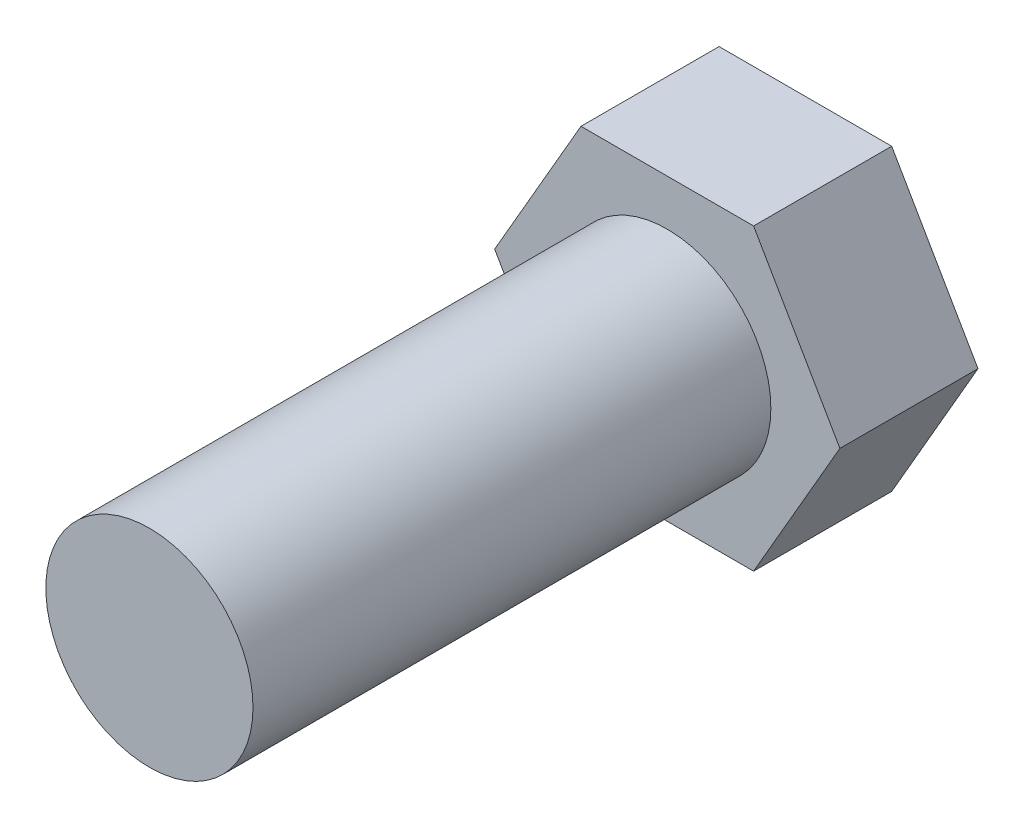
ISO-10303-21;
HEADER;
FILE_DESCRIPTION(('STEP AP214'),'2;1');
FILE_NAME('part.step','',(''),(''),'','','');
FILE_SCHEMA(('AUTOMOTIVE_DESIGN { 1 0 10303 214 1 1 1 1 }'));
ENDSEC;
DATA;
#1=APPLICATION_CONTEXT('core data for automotive mechanical design processes');
#2=APPLICATION_PROTOCOL_DEFINITION('international standard','automotive_design',2000,#1);
#3=PRODUCT_CONTEXT('',#1,'mechanical');
#4=PRODUCT('Part','Part','',(#3));
#5=PRODUCT_RELATED_PRODUCT_CATEGORY('part','',(#4));
#6=PRODUCT_DEFINITION_FORMATION('','',#4);
#7=PRODUCT_DEFINITION_CONTEXT('part definition',#1,'design');
#8=PRODUCT_DEFINITION('design','',#6,#7);
#9=PRODUCT_DEFINITION_SHAPE('','',#8);
#10=(LENGTH_UNIT() NAMED_UNIT(*) SI_UNIT(.MILLI.,.METRE.));
#11=(NAMED_UNIT(*) PLANE_ANGLE_UNIT() SI_UNIT($,.RADIAN.));
#12=(NAMED_UNIT(*) SI_UNIT($,.STERADIAN.) SOLID_ANGLE_UNIT());
#13=UNCERTAINTY_MEASURE_WITH_UNIT(LENGTH_MEASURE(1.E-05),#10,'distance_accuracy_value','');
#14=(GEOMETRIC_REPRESENTATION_CONTEXT(3) GLOBAL_UNCERTAINTY_ASSIGNED_CONTEXT((#13)) GLOBAL_UNIT_ASSIGNED_CONTEXT((#10,
#11,#12)) REPRESENTATION_CONTEXT('',''));
#15=CARTESIAN_POINT('',(0.,0.,0.));
#16=DIRECTION('',(0.,0.,1.));
#17=DIRECTION('',(1.,0.,0.));
#18=AXIS2_PLACEMENT_3D('',#15,#16,#17);
#19=CARTESIAN_POINT('',(0.,0.,15.));
#20=DIRECTION('',(0.,0.,-1.));
#21=DIRECTION('',(-1.,0.,0.));
#22=AXIS2_PLACEMENT_3D('',#19,#20,#21);
#23=CYLINDRICAL_SURFACE('',#22,3.);
#24=CARTESIAN_POINT('',(0.,0.,15.));
#25=DIRECTION('',(0.,0.,1.));
#26=DIRECTION('',(1.,0.,0.));
#27=AXIS2_PLACEMENT_3D('',#24,#25,#26);
#28=CIRCLE('',#27,3.);
#29=CARTESIAN_POINT('',(3.,0.,15.));
#30=VERTEX_POINT('',#29);
#31=EDGE_CURVE('E11',#30,#30,#28,.T.);
#32=ORIENTED_EDGE('',*,*,#31,.F.);
#33=EDGE_LOOP('',(#32));
#34=FACE_BOUND('',#33,.T.);
#35=CARTESIAN_POINT('',(0.,0.,0.));
#36=DIRECTION('',(0.,0.,1.));
#37=DIRECTION('',(1.,0.,0.));
#38=AXIS2_PLACEMENT_3D('',#35,#36,#37);
#39=CIRCLE('',#38,3.);
#40=CARTESIAN_POINT('',(3.,0.,0.));
#41=VERTEX_POINT('',#40);
#42=EDGE_CURVE('E37',#41,#41,#39,.T.);
#43=ORIENTED_EDGE('',*,*,#42,.T.);
#44=EDGE_LOOP('',(#43));
#45=FACE_BOUND('',#44,.T.);
#46=ADVANCED_FACE('F34',(#34,#45),#23,.T.);
#47=CARTESIAN_POINT('',(0.,0.,15.));
#48=DIRECTION('',(0.,0.,1.));
#49=DIRECTION('',(1.,0.,0.));
#50=AXIS2_PLACEMENT_3D('',#47,#48,#49);
#51=PLANE('',#50);
#52=ORIENTED_EDGE('',*,*,#31,.T.);
#53=EDGE_LOOP('',(#52));
#54=FACE_BOUND('',#53,.T.);
#55=ADVANCED_FACE('F161',(#54),#51,.T.);
#56=CARTESIAN_POINT('',(-2.5,-4.3301270189222,-4.));
#57=DIRECTION('',(0.866025403784439,0.499999999999999,0.));
#58=DIRECTION('',(-0.499999999999999,0.866025403784439,0.));
#59=AXIS2_PLACEMENT_3D('',#56,#57,#58);
#60=PLANE('',#59);
#61=DIRECTION('',(-0.5,0.866025403784439,0.));
#62=VECTOR('',#61,1.);
#63=CARTESIAN_POINT('',(-2.5,-4.3301270189222,0.));
#64=LINE('',#63,#62);
#65=CARTESIAN_POINT('',(-2.5,-4.3301270189222,0.));
#66=VERTEX_POINT('',#65);
#67=CARTESIAN_POINT('',(-5.,0.,0.));
#68=VERTEX_POINT('',#67);
#69=EDGE_CURVE('E119',#66,#68,#64,.T.);
#70=ORIENTED_EDGE('',*,*,#69,.T.);
#71=DIRECTION('',(0.,0.,1.));
#72=VECTOR('',#71,1.);
#73=CARTESIAN_POINT('',(-5.,0.,-4.));
#74=LINE('',#73,#72);
#75=CARTESIAN_POINT('',(-5.,0.,-4.));
#76=VERTEX_POINT('',#75);
#77=EDGE_CURVE('E136',#76,#68,#74,.T.);
#78=ORIENTED_EDGE('',*,*,#77,.F.);
#79=DIRECTION('',(-0.5,0.866025403784439,0.));
#80=VECTOR('',#79,1.);
#81=CARTESIAN_POINT('',(-2.5,-4.3301270189222,-4.));
#82=LINE('',#81,#80);
#83=CARTESIAN_POINT('',(-2.5,-4.3301270189222,-4.));
#84=VERTEX_POINT('',#83);
#85=EDGE_CURVE('E129',#84,#76,#82,.T.);
#86=ORIENTED_EDGE('',*,*,#85,.F.);
#87=DIRECTION('',(0.,0.,1.));
#88=VECTOR('',#87,1.);
#89=CARTESIAN_POINT('',(-2.5,-4.3301270189222,-4.));
#90=LINE('',#89,#88);
#91=EDGE_CURVE('E115',#84,#66,#90,.T.);
#92=ORIENTED_EDGE('',*,*,#91,.T.);
#93=EDGE_LOOP('',(#70,#78,#86,#92));
#94=FACE_BOUND('',#93,.T.);
#95=ADVANCED_FACE('F149',(#94),#60,.F.);
#96=CARTESIAN_POINT('',(-5.,0.,-4.));
#97=DIRECTION('',(0.866025403784439,-0.5,0.));
#98=DIRECTION('',(0.5,0.866025403784439,0.));
#99=AXIS2_PLACEMENT_3D('',#96,#97,#98);
#100=PLANE('',#99);
#101=DIRECTION('',(0.5,0.866025403784439,0.));
#102=VECTOR('',#101,1.);
#103=CARTESIAN_POINT('',(-5.,0.,0.));
#104=LINE('',#103,#102);
#105=CARTESIAN_POINT('',(-2.5,4.33012701892219,0.));
#106=VERTEX_POINT('',#105);
#107=EDGE_CURVE('E122',#68,#106,#104,.T.);
#108=ORIENTED_EDGE('',*,*,#107,.T.);
#109=DIRECTION('',(0.,0.,1.));
#110=VECTOR('',#109,1.);
#111=CARTESIAN_POINT('',(-2.5,4.33012701892219,-4.));
#112=LINE('',#111,#110);
#113=CARTESIAN_POINT('',(-2.5,4.33012701892219,-4.));
#114=VERTEX_POINT('',#113);
#115=EDGE_CURVE('E133',#114,#106,#112,.T.);
#116=ORIENTED_EDGE('',*,*,#115,.F.);
#117=DIRECTION('',(0.5,0.866025403784439,0.));
#118=VECTOR('',#117,1.);
#119=CARTESIAN_POINT('',(-5.,0.,-4.));
#120=LINE('',#119,#118);
#121=EDGE_CURVE('E88',#76,#114,#120,.T.);
#122=ORIENTED_EDGE('',*,*,#121,.F.);
#123=ORIENTED_EDGE('',*,*,#77,.T.);
#124=EDGE_LOOP('',(#108,#116,#122,#123));
#125=FACE_BOUND('',#124,.T.);
#126=ADVANCED_FACE('F171',(#125),#100,.F.);
#127=CARTESIAN_POINT('',(-2.5,4.33012701892219,-4.));
#128=DIRECTION('',(0.,-1.,0.));
#129=DIRECTION('',(0.,0.,-1.));
#130=AXIS2_PLACEMENT_3D('',#127,#128,#129);
#131=PLANE('',#130);
#132=DIRECTION('',(1.,0.,0.));
#133=VECTOR('',#132,1.);
#134=CARTESIAN_POINT('',(-2.5,4.33012701892219,0.));
#135=LINE('',#134,#133);
#136=CARTESIAN_POINT('',(2.5,4.33012701892219,0.));
#137=VERTEX_POINT('',#136);
#138=EDGE_CURVE('E124',#106,#137,#135,.T.);
#139=ORIENTED_EDGE('',*,*,#138,.T.);
#140=DIRECTION('',(0.,0.,1.));
#141=VECTOR('',#140,1.);
#142=CARTESIAN_POINT('',(2.5,4.33012701892219,-4.));
#143=LINE('',#142,#141);
#144=CARTESIAN_POINT('',(2.5,4.33012701892219,-4.));
#145=VERTEX_POINT('',#144);
#146=EDGE_CURVE('E110',#145,#137,#143,.T.);
#147=ORIENTED_EDGE('',*,*,#146,.F.);
#148=DIRECTION('',(1.,0.,0.));
#149=VECTOR('',#148,1.);
#150=CARTESIAN_POINT('',(-2.5,4.33012701892219,-4.));
#151=LINE('',#150,#149);
#152=EDGE_CURVE('E101',#114,#145,#151,.T.);
#153=ORIENTED_EDGE('',*,*,#152,.F.);
#154=ORIENTED_EDGE('',*,*,#115,.T.);
#155=EDGE_LOOP('',(#139,#147,#153,#154));
#156=FACE_BOUND('',#155,.T.);
#157=ADVANCED_FACE('F176',(#156),#131,.F.);
#158=CARTESIAN_POINT('',(2.5,4.33012701892219,-4.));
#159=DIRECTION('',(-0.866025403784439,-0.5,0.));
#160=DIRECTION('',(0.5,-0.866025403784439,0.));
#161=AXIS2_PLACEMENT_3D('',#158,#159,#160);
#162=PLANE('',#161);
#163=DIRECTION('',(0.5,-0.866025403784439,0.));
#164=VECTOR('',#163,1.);
#165=CARTESIAN_POINT('',(2.5,4.33012701892219,0.));
#166=LINE('',#165,#164);
#167=CARTESIAN_POINT('',(5.,0.,0.));
#168=VERTEX_POINT('',#167);
#169=EDGE_CURVE('E109',#137,#168,#166,.T.);
#170=ORIENTED_EDGE('',*,*,#169,.T.);
#171=DIRECTION('',(0.,0.,1.));
#172=VECTOR('',#171,1.);
#173=CARTESIAN_POINT('',(5.,0.,-4.));
#174=LINE('',#173,#172);
#175=CARTESIAN_POINT('',(5.,0.,-4.));
#176=VERTEX_POINT('',#175);
#177=EDGE_CURVE('E106',#176,#168,#174,.T.);
#178=ORIENTED_EDGE('',*,*,#177,.F.);
#179=DIRECTION('',(0.5,-0.866025403784439,0.));
#180=VECTOR('',#179,1.);
#181=CARTESIAN_POINT('',(2.5,4.33012701892219,-4.));
#182=LINE('',#181,#180);
#183=EDGE_CURVE('E95',#145,#176,#182,.T.);
#184=ORIENTED_EDGE('',*,*,#183,.F.);
#185=ORIENTED_EDGE('',*,*,#146,.T.);
#186=EDGE_LOOP('',(#170,#178,#184,#185));
#187=FACE_BOUND('',#186,.T.);
#188=ADVANCED_FACE('F107',(#187),#162,.F.);
#189=CARTESIAN_POINT('',(5.,0.,-4.));
#190=DIRECTION('',(-0.866025403784439,0.5,0.));
#191=DIRECTION('',(-0.5,-0.866025403784439,0.));
#192=AXIS2_PLACEMENT_3D('',#189,#190,#191);
#193=PLANE('',#192);
#194=DIRECTION('',(-0.5,-0.866025403784439,0.));
#195=VECTOR('',#194,1.);
#196=CARTESIAN_POINT('',(5.,0.,0.));
#197=LINE('',#196,#195);
#198=CARTESIAN_POINT('',(2.5,-4.3301270189222,0.));
#199=VERTEX_POINT('',#198);
#200=EDGE_CURVE('E73',#168,#199,#197,.T.);
#201=ORIENTED_EDGE('',*,*,#200,.T.);
#202=DIRECTION('',(0.,0.,1.));
#203=VECTOR('',#202,1.);
#204=CARTESIAN_POINT('',(2.5,-4.3301270189222,-4.));
#205=LINE('',#204,#203);
#206=CARTESIAN_POINT('',(2.5,-4.3301270189222,-4.));
#207=VERTEX_POINT('',#206);
#208=EDGE_CURVE('E111',#207,#199,#205,.T.);
#209=ORIENTED_EDGE('',*,*,#208,.F.);
#210=DIRECTION('',(-0.5,-0.866025403784439,0.));
#211=VECTOR('',#210,1.);
#212=CARTESIAN_POINT('',(5.,0.,-4.));
#213=LINE('',#212,#211);
#214=EDGE_CURVE('E99',#176,#207,#213,.T.);
#215=ORIENTED_EDGE('',*,*,#214,.F.);
#216=ORIENTED_EDGE('',*,*,#177,.T.);
#217=EDGE_LOOP('',(#201,#209,#215,#216));
#218=FACE_BOUND('',#217,.T.);
#219=ADVANCED_FACE('F113',(#218),#193,.F.);
#220=CARTESIAN_POINT('',(2.5,-4.3301270189222,-4.));
#221=DIRECTION('',(0.,1.,0.));
#222=DIRECTION('',(0.,0.,1.));
#223=AXIS2_PLACEMENT_3D('',#220,#221,#222);
#224=PLANE('',#223);
#225=DIRECTION('',(-1.,0.,0.));
#226=VECTOR('',#225,1.);
#227=CARTESIAN_POINT('',(2.5,-4.3301270189222,0.));
#228=LINE('',#227,#226);
#229=EDGE_CURVE('E79',#199,#66,#228,.T.);
#230=ORIENTED_EDGE('',*,*,#229,.T.);
#231=ORIENTED_EDGE('',*,*,#91,.F.);
#232=DIRECTION('',(-1.,0.,0.));
#233=VECTOR('',#232,1.);
#234=CARTESIAN_POINT('',(2.5,-4.3301270189222,-4.));
#235=LINE('',#234,#233);
#236=EDGE_CURVE('E50',#207,#84,#235,.T.);
#237=ORIENTED_EDGE('',*,*,#236,.F.);
#238=ORIENTED_EDGE('',*,*,#208,.T.);
#239=EDGE_LOOP('',(#230,#231,#237,#238));
#240=FACE_BOUND('',#239,.T.);
#241=ADVANCED_FACE('F151',(#240),#224,.F.);
#242=CARTESIAN_POINT('',(0.,0.,-4.));
#243=DIRECTION('',(0.,0.,-1.));
#244=DIRECTION('',(-1.,0.,0.));
#245=AXIS2_PLACEMENT_3D('',#242,#243,#244);
#246=PLANE('',#245);
#247=ORIENTED_EDGE('',*,*,#85,.T.);
#248=ORIENTED_EDGE('',*,*,#121,.T.);
#249=ORIENTED_EDGE('',*,*,#152,.T.);
#250=ORIENTED_EDGE('',*,*,#183,.T.);
#251=ORIENTED_EDGE('',*,*,#214,.T.);
#252=ORIENTED_EDGE('',*,*,#236,.T.);
#253=EDGE_LOOP('',(#247,#248,#249,#250,#251,#252));
#254=FACE_BOUND('',#253,.T.);
#255=ADVANCED_FACE('F97',(#254),#246,.T.);
#256=CARTESIAN_POINT('',(0.,0.,0.));
#257=DIRECTION('',(0.,0.,-1.));
#258=DIRECTION('',(-1.,0.,0.));
#259=AXIS2_PLACEMENT_3D('',#256,#257,#258);
#260=PLANE('',#259);
#261=ORIENTED_EDGE('',*,*,#42,.F.);
#262=EDGE_LOOP('',(#261));
#263=FACE_BOUND('',#262,.T.);
#264=ORIENTED_EDGE('',*,*,#69,.F.);
#265=ORIENTED_EDGE('',*,*,#229,.F.);
#266=ORIENTED_EDGE('',*,*,#200,.F.);
#267=ORIENTED_EDGE('',*,*,#169,.F.);
#268=ORIENTED_EDGE('',*,*,#138,.F.);
#269=ORIENTED_EDGE('',*,*,#107,.F.);
#270=EDGE_LOOP('',(#264,#265,#266,#267,#268,#269));
#271=FACE_BOUND('',#270,.T.);
#272=ADVANCED_FACE('F142',(#263,#271),#260,.F.);
#273=CLOSED_SHELL('',(#46,#55,#95,#126,#157,#188,#219,#241,#255,#272));
#274=MANIFOLD_SOLID_BREP('B2',#273);
#275=ADVANCED_BREP_SHAPE_REPRESENTATION('',(#18,#274),#14);
#276=SHAPE_DEFINITION_REPRESENTATION(#9,#275);
ENDSEC;
END-ISO-10303-21;
